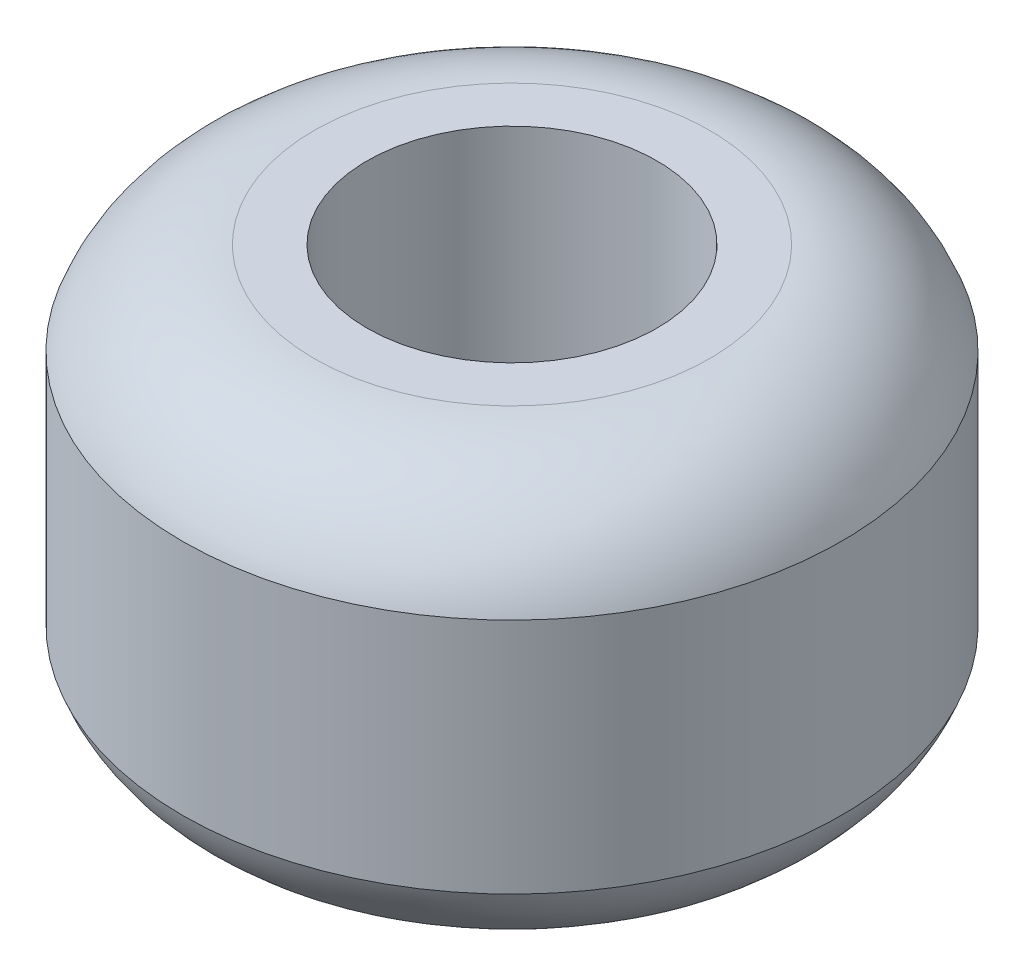
ISO-10303-21;
HEADER;
FILE_DESCRIPTION(('STEP AP214'),'2;1');
FILE_NAME('part.step','',(''),(''),'','','');
FILE_SCHEMA(('AUTOMOTIVE_DESIGN { 1 0 10303 214 1 1 1 1 }'));
ENDSEC;
DATA;
#1=APPLICATION_CONTEXT('core data for automotive mechanical design processes');
#2=APPLICATION_PROTOCOL_DEFINITION('international standard','automotive_design',2000,#1);
#3=PRODUCT_CONTEXT('',#1,'mechanical');
#4=PRODUCT('Part','Part','',(#3));
#5=PRODUCT_RELATED_PRODUCT_CATEGORY('part','',(#4));
#6=PRODUCT_DEFINITION_FORMATION('','',#4);
#7=PRODUCT_DEFINITION_CONTEXT('part definition',#1,'design');
#8=PRODUCT_DEFINITION('design','',#6,#7);
#9=PRODUCT_DEFINITION_SHAPE('','',#8);
#10=(LENGTH_UNIT() NAMED_UNIT(*) SI_UNIT(.MILLI.,.METRE.));
#11=(NAMED_UNIT(*) PLANE_ANGLE_UNIT() SI_UNIT($,.RADIAN.));
#12=(NAMED_UNIT(*) SI_UNIT($,.STERADIAN.) SOLID_ANGLE_UNIT());
#13=UNCERTAINTY_MEASURE_WITH_UNIT(LENGTH_MEASURE(1.E-05),#10,'distance_accuracy_value','');
#14=(GEOMETRIC_REPRESENTATION_CONTEXT(3) GLOBAL_UNCERTAINTY_ASSIGNED_CONTEXT((#13)) GLOBAL_UNIT_ASSIGNED_CONTEXT((#10,
#11,#12)) REPRESENTATION_CONTEXT('',''));
#15=CARTESIAN_POINT('',(0.,0.,0.));
#16=DIRECTION('',(0.,0.,1.));
#17=DIRECTION('',(1.,0.,0.));
#18=AXIS2_PLACEMENT_3D('',#15,#16,#17);
#19=CARTESIAN_POINT('',(11.,-16.,0.));
#20=DIRECTION('',(0.,1.,0.));
#21=DIRECTION('',(0.,0.,1.));
#22=AXIS2_PLACEMENT_3D('',#19,#20,#21);
#23=PLANE('',#22);
#24=CARTESIAN_POINT('',(0.,-16.,0.));
#25=DIRECTION('',(0.,1.,0.));
#26=DIRECTION('',(0.,0.,1.));
#27=AXIS2_PLACEMENT_3D('',#24,#25,#26);
#28=CIRCLE('',#27,15.);
#29=CARTESIAN_POINT('',(0.,-16.,15.));
#30=VERTEX_POINT('',#29);
#31=EDGE_CURVE('E10',#30,#30,#28,.T.);
#32=ORIENTED_EDGE('',*,*,#31,.F.);
#33=EDGE_LOOP('',(#32));
#34=FACE_BOUND('',#33,.T.);
#35=CARTESIAN_POINT('',(0.,-16.,0.));
#36=DIRECTION('',(0.,1.,0.));
#37=DIRECTION('',(0.,0.,1.));
#38=AXIS2_PLACEMENT_3D('',#35,#36,#37);
#39=CIRCLE('',#38,11.);
#40=CARTESIAN_POINT('',(0.,-16.,11.));
#41=VERTEX_POINT('',#40);
#42=EDGE_CURVE('E52',#41,#41,#39,.T.);
#43=ORIENTED_EDGE('',*,*,#42,.T.);
#44=EDGE_LOOP('',(#43));
#45=FACE_BOUND('',#44,.T.);
#46=ADVANCED_FACE('F30',(#34,#45),#23,.F.);
#47=CARTESIAN_POINT('',(0.,-5.35714285714285,0.));
#48=DIRECTION('',(0.,1.,0.));
#49=DIRECTION('',(0.,0.,1.));
#50=AXIS2_PLACEMENT_3D('',#47,#48,#49);
#51=TOROIDAL_SURFACE('',#50,15.,10.6428571428571);
#52=CARTESIAN_POINT('',(0.,-9.,0.));
#53=DIRECTION('',(0.,1.,0.));
#54=DIRECTION('',(0.,0.,1.));
#55=AXIS2_PLACEMENT_3D('',#52,#53,#54);
#56=CIRCLE('',#55,25.);
#57=CARTESIAN_POINT('',(0.,-9.,25.));
#58=VERTEX_POINT('',#57);
#59=EDGE_CURVE('E36',#58,#58,#56,.T.);
#60=ORIENTED_EDGE('',*,*,#59,.F.);
#61=EDGE_LOOP('',(#60));
#62=FACE_BOUND('',#61,.T.);
#63=ORIENTED_EDGE('',*,*,#31,.T.);
#64=EDGE_LOOP('',(#63));
#65=FACE_BOUND('',#64,.T.);
#66=ADVANCED_FACE('F77',(#62,#65),#51,.T.);
#67=CARTESIAN_POINT('',(0.,0.,0.));
#68=DIRECTION('',(0.,1.,0.));
#69=DIRECTION('',(0.,0.,1.));
#70=AXIS2_PLACEMENT_3D('',#67,#68,#69);
#71=CYLINDRICAL_SURFACE('',#70,25.);
#72=CARTESIAN_POINT('',(0.,9.,0.));
#73=DIRECTION('',(0.,1.,0.));
#74=DIRECTION('',(0.,0.,1.));
#75=AXIS2_PLACEMENT_3D('',#72,#73,#74);
#76=CIRCLE('',#75,25.);
#77=CARTESIAN_POINT('',(0.,9.,25.));
#78=VERTEX_POINT('',#77);
#79=EDGE_CURVE('E40',#78,#78,#76,.T.);
#80=ORIENTED_EDGE('',*,*,#79,.F.);
#81=EDGE_LOOP('',(#80));
#82=FACE_BOUND('',#81,.T.);
#83=ORIENTED_EDGE('',*,*,#59,.T.);
#84=EDGE_LOOP('',(#83));
#85=FACE_BOUND('',#84,.T.);
#86=ADVANCED_FACE('F72',(#82,#85),#71,.T.);
#87=CARTESIAN_POINT('',(0.,5.35714285714285,0.));
#88=DIRECTION('',(0.,1.,0.));
#89=DIRECTION('',(0.,0.,1.));
#90=AXIS2_PLACEMENT_3D('',#87,#88,#89);
#91=TOROIDAL_SURFACE('',#90,15.,10.6428571428571);
#92=CARTESIAN_POINT('',(0.,16.,0.));
#93=DIRECTION('',(0.,1.,0.));
#94=DIRECTION('',(0.,0.,1.));
#95=AXIS2_PLACEMENT_3D('',#92,#93,#94);
#96=CIRCLE('',#95,15.);
#97=CARTESIAN_POINT('',(0.,16.,15.));
#98=VERTEX_POINT('',#97);
#99=EDGE_CURVE('E44',#98,#98,#96,.T.);
#100=ORIENTED_EDGE('',*,*,#99,.F.);
#101=EDGE_LOOP('',(#100));
#102=FACE_BOUND('',#101,.T.);
#103=ORIENTED_EDGE('',*,*,#79,.T.);
#104=EDGE_LOOP('',(#103));
#105=FACE_BOUND('',#104,.T.);
#106=ADVANCED_FACE('F66',(#102,#105),#91,.T.);
#107=CARTESIAN_POINT('',(11.,16.,0.));
#108=DIRECTION('',(0.,-1.,0.));
#109=DIRECTION('',(0.,0.,-1.));
#110=AXIS2_PLACEMENT_3D('',#107,#108,#109);
#111=PLANE('',#110);
#112=CARTESIAN_POINT('',(0.,16.,0.));
#113=DIRECTION('',(0.,1.,0.));
#114=DIRECTION('',(0.,0.,1.));
#115=AXIS2_PLACEMENT_3D('',#112,#113,#114);
#116=CIRCLE('',#115,11.);
#117=CARTESIAN_POINT('',(0.,16.,11.));
#118=VERTEX_POINT('',#117);
#119=EDGE_CURVE('E49',#118,#118,#116,.T.);
#120=ORIENTED_EDGE('',*,*,#119,.F.);
#121=EDGE_LOOP('',(#120));
#122=FACE_BOUND('',#121,.T.);
#123=ORIENTED_EDGE('',*,*,#99,.T.);
#124=EDGE_LOOP('',(#123));
#125=FACE_BOUND('',#124,.T.);
#126=ADVANCED_FACE('F60',(#122,#125),#111,.F.);
#127=CARTESIAN_POINT('',(0.,0.,0.));
#128=DIRECTION('',(0.,1.,0.));
#129=DIRECTION('',(0.,0.,1.));
#130=AXIS2_PLACEMENT_3D('',#127,#128,#129);
#131=CYLINDRICAL_SURFACE('',#130,11.);
#132=ORIENTED_EDGE('',*,*,#42,.F.);
#133=EDGE_LOOP('',(#132));
#134=FACE_BOUND('',#133,.T.);
#135=ORIENTED_EDGE('',*,*,#119,.T.);
#136=EDGE_LOOP('',(#135));
#137=FACE_BOUND('',#136,.T.);
#138=ADVANCED_FACE('F57',(#134,#137),#131,.F.);
#139=CLOSED_SHELL('',(#46,#66,#86,#106,#126,#138));
#140=MANIFOLD_SOLID_BREP('B2',#139);
#141=ADVANCED_BREP_SHAPE_REPRESENTATION('',(#18,#140),#14);
#142=SHAPE_DEFINITION_REPRESENTATION(#9,#141);
ENDSEC;
END-ISO-10303-21;
